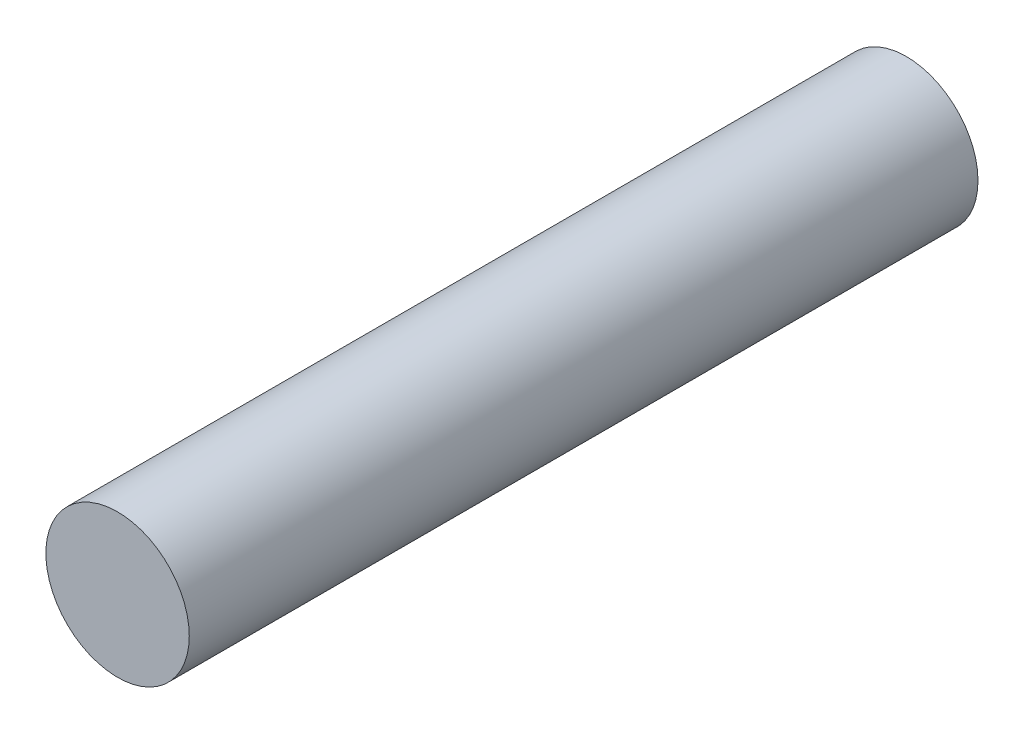
ISO-10303-21;
HEADER;
FILE_DESCRIPTION(('STEP AP214'),'2;1');
FILE_NAME('part.step','',(''),(''),'','','');
FILE_SCHEMA(('AUTOMOTIVE_DESIGN { 1 0 10303 214 1 1 1 1 }'));
ENDSEC;
DATA;
#1=APPLICATION_CONTEXT('core data for automotive mechanical design processes');
#2=APPLICATION_PROTOCOL_DEFINITION('international standard','automotive_design',2000,#1);
#3=PRODUCT_CONTEXT('',#1,'mechanical');
#4=PRODUCT('Part','Part','',(#3));
#5=PRODUCT_RELATED_PRODUCT_CATEGORY('part','',(#4));
#6=PRODUCT_DEFINITION_FORMATION('','',#4);
#7=PRODUCT_DEFINITION_CONTEXT('part definition',#1,'design');
#8=PRODUCT_DEFINITION('design','',#6,#7);
#9=PRODUCT_DEFINITION_SHAPE('','',#8);
#10=(LENGTH_UNIT() NAMED_UNIT(*) SI_UNIT(.MILLI.,.METRE.));
#11=(NAMED_UNIT(*) PLANE_ANGLE_UNIT() SI_UNIT($,.RADIAN.));
#12=(NAMED_UNIT(*) SI_UNIT($,.STERADIAN.) SOLID_ANGLE_UNIT());
#13=UNCERTAINTY_MEASURE_WITH_UNIT(LENGTH_MEASURE(1.E-05),#10,'distance_accuracy_value','');
#14=(GEOMETRIC_REPRESENTATION_CONTEXT(3) GLOBAL_UNCERTAINTY_ASSIGNED_CONTEXT((#13)) GLOBAL_UNIT_ASSIGNED_CONTEXT((#10,
#11,#12)) REPRESENTATION_CONTEXT('',''));
#15=CARTESIAN_POINT('',(0.,0.,0.));
#16=DIRECTION('',(0.,0.,1.));
#17=DIRECTION('',(1.,0.,0.));
#18=AXIS2_PLACEMENT_3D('',#15,#16,#17);
#19=CARTESIAN_POINT('',(0.,0.,-55.));
#20=DIRECTION('',(0.,0.,1.));
#21=DIRECTION('',(1.,0.,0.));
#22=AXIS2_PLACEMENT_3D('',#19,#20,#21);
#23=CYLINDRICAL_SURFACE('',#22,10.);
#24=CARTESIAN_POINT('',(0.,0.,-55.));
#25=DIRECTION('',(0.,0.,1.));
#26=DIRECTION('',(1.,0.,0.));
#27=AXIS2_PLACEMENT_3D('',#24,#25,#26);
#28=CIRCLE('',#27,10.);
#29=CARTESIAN_POINT('',(10.,0.,-55.));
#30=VERTEX_POINT('',#29);
#31=EDGE_CURVE('E10',#30,#30,#28,.T.);
#32=ORIENTED_EDGE('',*,*,#31,.T.);
#33=EDGE_LOOP('',(#32));
#34=FACE_BOUND('',#33,.T.);
#35=CARTESIAN_POINT('',(0.,0.,55.));
#36=DIRECTION('',(0.,0.,1.));
#37=DIRECTION('',(1.,0.,0.));
#38=AXIS2_PLACEMENT_3D('',#35,#36,#37);
#39=CIRCLE('',#38,10.);
#40=CARTESIAN_POINT('',(10.,0.,55.));
#41=VERTEX_POINT('',#40);
#42=EDGE_CURVE('E48',#41,#41,#39,.T.);
#43=ORIENTED_EDGE('',*,*,#42,.F.);
#44=EDGE_LOOP('',(#43));
#45=FACE_BOUND('',#44,.T.);
#46=ADVANCED_FACE('F41',(#34,#45),#23,.T.);
#47=CARTESIAN_POINT('',(0.,0.,-55.));
#48=DIRECTION('',(0.,0.,1.));
#49=DIRECTION('',(1.,0.,0.));
#50=AXIS2_PLACEMENT_3D('',#47,#48,#49);
#51=PLANE('',#50);
#52=ORIENTED_EDGE('',*,*,#31,.F.);
#53=EDGE_LOOP('',(#52));
#54=FACE_BOUND('',#53,.T.);
#55=ADVANCED_FACE('F58',(#54),#51,.F.);
#56=CARTESIAN_POINT('',(0.,0.,55.));
#57=DIRECTION('',(0.,0.,1.));
#58=DIRECTION('',(1.,0.,0.));
#59=AXIS2_PLACEMENT_3D('',#56,#57,#58);
#60=PLANE('',#59);
#61=ORIENTED_EDGE('',*,*,#42,.T.);
#62=EDGE_LOOP('',(#61));
#63=FACE_BOUND('',#62,.T.);
#64=ADVANCED_FACE('F55',(#63),#60,.T.);
#65=CLOSED_SHELL('',(#46,#55,#64));
#66=MANIFOLD_SOLID_BREP('B2',#65);
#67=ADVANCED_BREP_SHAPE_REPRESENTATION('',(#18,#66),#14);
#68=SHAPE_DEFINITION_REPRESENTATION(#9,#67);
ENDSEC;
END-ISO-10303-21;
